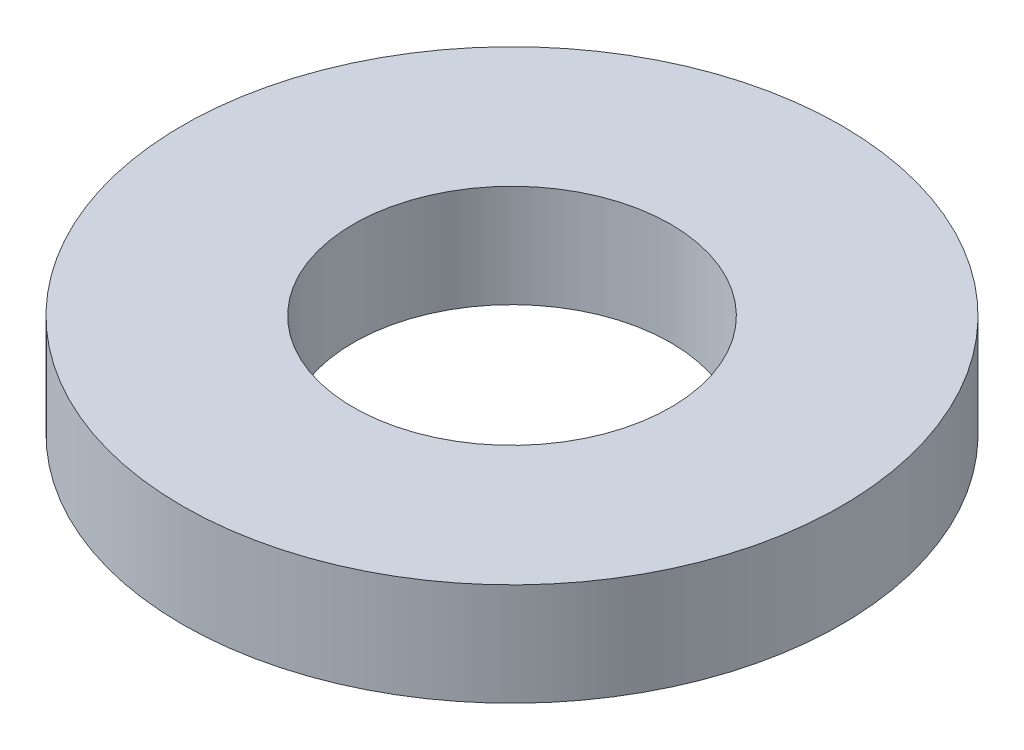
ISO-10303-21;
HEADER;
FILE_DESCRIPTION(('STEP AP214'),'2;1');
FILE_NAME('part.step','',(''),(''),'','','');
FILE_SCHEMA(('AUTOMOTIVE_DESIGN { 1 0 10303 214 1 1 1 1 }'));
ENDSEC;
DATA;
#1=APPLICATION_CONTEXT('core data for automotive mechanical design processes');
#2=APPLICATION_PROTOCOL_DEFINITION('international standard','automotive_design',2000,#1);
#3=PRODUCT_CONTEXT('',#1,'mechanical');
#4=PRODUCT('Part','Part','',(#3));
#5=PRODUCT_RELATED_PRODUCT_CATEGORY('part','',(#4));
#6=PRODUCT_DEFINITION_FORMATION('','',#4);
#7=PRODUCT_DEFINITION_CONTEXT('part definition',#1,'design');
#8=PRODUCT_DEFINITION('design','',#6,#7);
#9=PRODUCT_DEFINITION_SHAPE('','',#8);
#10=(LENGTH_UNIT() NAMED_UNIT(*) SI_UNIT(.MILLI.,.METRE.));
#11=(NAMED_UNIT(*) PLANE_ANGLE_UNIT() SI_UNIT($,.RADIAN.));
#12=(NAMED_UNIT(*) SI_UNIT($,.STERADIAN.) SOLID_ANGLE_UNIT());
#13=UNCERTAINTY_MEASURE_WITH_UNIT(LENGTH_MEASURE(1.E-05),#10,'distance_accuracy_value','');
#14=(GEOMETRIC_REPRESENTATION_CONTEXT(3) GLOBAL_UNCERTAINTY_ASSIGNED_CONTEXT((#13)) GLOBAL_UNIT_ASSIGNED_CONTEXT((#10,
#11,#12)) REPRESENTATION_CONTEXT('',''));
#15=CARTESIAN_POINT('',(0.,0.,0.));
#16=DIRECTION('',(0.,0.,1.));
#17=DIRECTION('',(1.,0.,0.));
#18=AXIS2_PLACEMENT_3D('',#15,#16,#17);
#19=CARTESIAN_POINT('',(0.,21.,0.));
#20=DIRECTION('',(0.,-1.,0.));
#21=DIRECTION('',(0.,0.,-1.));
#22=AXIS2_PLACEMENT_3D('',#19,#20,#21);
#23=CYLINDRICAL_SURFACE('',#22,67.5);
#24=CARTESIAN_POINT('',(0.,21.,0.));
#25=DIRECTION('',(0.,1.,0.));
#26=DIRECTION('',(0.,0.,1.));
#27=AXIS2_PLACEMENT_3D('',#24,#25,#26);
#28=CIRCLE('',#27,67.5);
#29=CARTESIAN_POINT('',(0.,21.,-67.5));
#30=VERTEX_POINT('',#29);
#31=EDGE_CURVE('E10',#30,#30,#28,.T.);
#32=CARTESIAN_POINT('',(0.,0.,0.));
#33=DIRECTION('',(0.,1.,0.));
#34=DIRECTION('',(0.,0.,1.));
#35=AXIS2_PLACEMENT_3D('',#32,#33,#34);
#36=CIRCLE('',#35,67.5);
#37=CARTESIAN_POINT('',(0.,0.,-67.5));
#38=VERTEX_POINT('',#37);
#39=EDGE_CURVE('E37',#38,#38,#36,.T.);
#40=CARTESIAN_POINT('',(0.,21.,-67.5));
#41=CARTESIAN_POINT('',(0.,20.78125,-67.5));
#42=CARTESIAN_POINT('',(0.,20.5625,-67.5));
#43=CARTESIAN_POINT('',(0.,20.125,-67.5));
#44=CARTESIAN_POINT('',(0.,19.90625,-67.5));
#45=CARTESIAN_POINT('',(0.,19.46875,-67.5));
#46=CARTESIAN_POINT('',(0.,19.25,-67.5));
#47=CARTESIAN_POINT('',(0.,18.8125,-67.5));
#48=CARTESIAN_POINT('',(0.,18.59375,-67.5));
#49=CARTESIAN_POINT('',(0.,18.15625,-67.5));
#50=CARTESIAN_POINT('',(0.,17.9375,-67.5));
#51=CARTESIAN_POINT('',(0.,17.5,-67.5));
#52=CARTESIAN_POINT('',(0.,17.28125,-67.5));
#53=CARTESIAN_POINT('',(0.,16.84375,-67.5));
#54=CARTESIAN_POINT('',(0.,16.625,-67.5));
#55=CARTESIAN_POINT('',(0.,16.1875,-67.5));
#56=CARTESIAN_POINT('',(0.,15.96875,-67.5));
#57=CARTESIAN_POINT('',(0.,15.53125,-67.5));
#58=CARTESIAN_POINT('',(0.,15.3125,-67.5));
#59=CARTESIAN_POINT('',(0.,14.875,-67.5));
#60=CARTESIAN_POINT('',(0.,14.65625,-67.5));
#61=CARTESIAN_POINT('',(0.,14.21875,-67.5));
#62=CARTESIAN_POINT('',(0.,14.,-67.5));
#63=CARTESIAN_POINT('',(0.,13.5625,-67.5));
#64=CARTESIAN_POINT('',(0.,13.34375,-67.5));
#65=CARTESIAN_POINT('',(0.,12.90625,-67.5));
#66=CARTESIAN_POINT('',(0.,12.6875,-67.5));
#67=CARTESIAN_POINT('',(0.,12.25,-67.5));
#68=CARTESIAN_POINT('',(0.,12.03125,-67.5));
#69=CARTESIAN_POINT('',(0.,11.59375,-67.5));
#70=CARTESIAN_POINT('',(0.,11.375,-67.5));
#71=CARTESIAN_POINT('',(0.,10.9375,-67.5));
#72=CARTESIAN_POINT('',(0.,10.71875,-67.5));
#73=CARTESIAN_POINT('',(0.,10.28125,-67.5));
#74=CARTESIAN_POINT('',(0.,10.0625,-67.5));
#75=CARTESIAN_POINT('',(0.,9.625,-67.5));
#76=CARTESIAN_POINT('',(0.,9.40625,-67.5));
#77=CARTESIAN_POINT('',(0.,8.96875,-67.5));
#78=CARTESIAN_POINT('',(0.,8.75,-67.5));
#79=CARTESIAN_POINT('',(0.,8.3125,-67.5));
#80=CARTESIAN_POINT('',(0.,8.09375,-67.5));
#81=CARTESIAN_POINT('',(0.,7.65625,-67.5));
#82=CARTESIAN_POINT('',(0.,7.4375,-67.5));
#83=CARTESIAN_POINT('',(0.,7.,-67.5));
#84=CARTESIAN_POINT('',(0.,6.78125,-67.5));
#85=CARTESIAN_POINT('',(0.,6.34375,-67.5));
#86=CARTESIAN_POINT('',(0.,6.125,-67.5));
#87=CARTESIAN_POINT('',(0.,5.6875,-67.5));
#88=CARTESIAN_POINT('',(0.,5.46875,-67.5));
#89=CARTESIAN_POINT('',(0.,5.03125,-67.5));
#90=CARTESIAN_POINT('',(0.,4.8125,-67.5));
#91=CARTESIAN_POINT('',(0.,4.375,-67.5));
#92=CARTESIAN_POINT('',(0.,4.15625,-67.5));
#93=CARTESIAN_POINT('',(0.,3.71875,-67.5));
#94=CARTESIAN_POINT('',(0.,3.5,-67.5));
#95=CARTESIAN_POINT('',(0.,3.0625,-67.5));
#96=CARTESIAN_POINT('',(0.,2.84375,-67.5));
#97=CARTESIAN_POINT('',(0.,2.40625,-67.5));
#98=CARTESIAN_POINT('',(0.,2.1875,-67.5));
#99=CARTESIAN_POINT('',(0.,1.75,-67.5));
#100=CARTESIAN_POINT('',(0.,1.53125,-67.5));
#101=CARTESIAN_POINT('',(0.,1.09375,-67.5));
#102=CARTESIAN_POINT('',(0.,0.875000000000001,-67.5));
#103=CARTESIAN_POINT('',(0.,0.4375,-67.5));
#104=CARTESIAN_POINT('',(0.,0.21875,-67.5));
#105=CARTESIAN_POINT('',(0.,0.,-67.5));
#106=B_SPLINE_CURVE_WITH_KNOTS('',3,(#40,#41,#42,#43,#44,#45,#46,#47,#48,#49,#50,#51,#52,#53,
#54,#55,#56,#57,#58,#59,#60,#61,#62,#63,#64,#65,#66,#67,#68,#69,#70,#71,#72,#73,#74,#75,#76,#77,
#78,#79,#80,#81,#82,#83,#84,#85,#86,#87,#88,#89,#90,#91,#92,#93,#94,#95,#96,#97,#98,#99,#100,
#101,#102,#103,#104,#105),.UNSPECIFIED.,.F.,.F.,(4,2,2,2,2,2,2,2,2,2,2,2,2,2,2,2,2,2,2,2,2,2,2,
2,2,2,2,2,2,2,2,2,4),(0.,0.656250000000001,1.3125,1.96875,2.625,3.28125,3.9375,4.59375,5.25,
5.90625,6.5625,7.21875,7.875,8.53125,9.1875,9.84375,10.5,11.15625,11.8125,12.46875,13.125,
13.78125,14.4375,15.09375,15.75,16.40625,17.0625,17.71875,18.375,19.03125,19.6875,20.34375,21.),.UNSPECIFIED.);
#107=EDGE_CURVE('BSEAM40',#30,#38,#106,.T.);
#108=ORIENTED_EDGE('',*,*,#31,.F.);
#109=ORIENTED_EDGE('',*,*,#39,.T.);
#110=ORIENTED_EDGE('',*,*,#107,.T.);
#111=ORIENTED_EDGE('',*,*,#107,.F.);
#112=EDGE_LOOP('',(#108,#110,#109,#111));
#113=FACE_BOUND('',#112,.T.);
#114=ADVANCED_FACE('F40',(#113),#23,.T.);
#115=CARTESIAN_POINT('',(0.,21.,0.));
#116=DIRECTION('',(0.,1.,0.));
#117=DIRECTION('',(0.,0.,1.));
#118=AXIS2_PLACEMENT_3D('',#115,#116,#117);
#119=PLANE('',#118);
#120=CARTESIAN_POINT('',(0.,21.,0.));
#121=DIRECTION('',(0.,1.,0.));
#122=DIRECTION('',(0.,0.,1.));
#123=AXIS2_PLACEMENT_3D('',#120,#121,#122);
#124=CIRCLE('',#123,32.5);
#125=CARTESIAN_POINT('',(0.,21.,-32.5));
#126=VERTEX_POINT('',#125);
#127=EDGE_CURVE('E50',#126,#126,#124,.T.);
#128=ORIENTED_EDGE('',*,*,#127,.F.);
#129=EDGE_LOOP('',(#128));
#130=FACE_BOUND('',#129,.T.);
#131=ORIENTED_EDGE('',*,*,#31,.T.);
#132=EDGE_LOOP('',(#131));
#133=FACE_BOUND('',#132,.T.);
#134=ADVANCED_FACE('F59',(#130,#133),#119,.T.);
#135=CARTESIAN_POINT('',(0.,0.,0.));
#136=DIRECTION('',(0.,1.,0.));
#137=DIRECTION('',(0.,0.,1.));
#138=AXIS2_PLACEMENT_3D('',#135,#136,#137);
#139=PLANE('',#138);
#140=CARTESIAN_POINT('',(0.,0.,0.));
#141=DIRECTION('',(0.,1.,0.));
#142=DIRECTION('',(0.,0.,1.));
#143=AXIS2_PLACEMENT_3D('',#140,#141,#142);
#144=CIRCLE('',#143,32.5);
#145=CARTESIAN_POINT('',(0.,0.,-32.5));
#146=VERTEX_POINT('',#145);
#147=EDGE_CURVE('E47',#146,#146,#144,.T.);
#148=ORIENTED_EDGE('',*,*,#147,.T.);
#149=EDGE_LOOP('',(#148));
#150=FACE_BOUND('',#149,.T.);
#151=ORIENTED_EDGE('',*,*,#39,.F.);
#152=EDGE_LOOP('',(#151));
#153=FACE_BOUND('',#152,.T.);
#154=ADVANCED_FACE('F58',(#150,#153),#139,.F.);
#155=CARTESIAN_POINT('',(0.,21.,0.));
#156=DIRECTION('',(0.,-1.,0.));
#157=DIRECTION('',(0.,0.,-1.));
#158=AXIS2_PLACEMENT_3D('',#155,#156,#157);
#159=CYLINDRICAL_SURFACE('',#158,32.5);
#160=CARTESIAN_POINT('',(0.,21.,-32.5));
#161=CARTESIAN_POINT('',(0.,20.78125,-32.5));
#162=CARTESIAN_POINT('',(0.,20.5625,-32.5));
#163=CARTESIAN_POINT('',(0.,20.125,-32.5));
#164=CARTESIAN_POINT('',(0.,19.90625,-32.5));
#165=CARTESIAN_POINT('',(0.,19.46875,-32.5));
#166=CARTESIAN_POINT('',(0.,19.25,-32.5));
#167=CARTESIAN_POINT('',(0.,18.8125,-32.5));
#168=CARTESIAN_POINT('',(0.,18.59375,-32.5));
#169=CARTESIAN_POINT('',(0.,18.15625,-32.5));
#170=CARTESIAN_POINT('',(0.,17.9375,-32.5));
#171=CARTESIAN_POINT('',(0.,17.5,-32.5));
#172=CARTESIAN_POINT('',(0.,17.28125,-32.5));
#173=CARTESIAN_POINT('',(0.,16.84375,-32.5));
#174=CARTESIAN_POINT('',(0.,16.625,-32.5));
#175=CARTESIAN_POINT('',(0.,16.1875,-32.5));
#176=CARTESIAN_POINT('',(0.,15.96875,-32.5));
#177=CARTESIAN_POINT('',(0.,15.53125,-32.5));
#178=CARTESIAN_POINT('',(0.,15.3125,-32.5));
#179=CARTESIAN_POINT('',(0.,14.875,-32.5));
#180=CARTESIAN_POINT('',(0.,14.65625,-32.5));
#181=CARTESIAN_POINT('',(0.,14.21875,-32.5));
#182=CARTESIAN_POINT('',(0.,14.,-32.5));
#183=CARTESIAN_POINT('',(0.,13.5625,-32.5));
#184=CARTESIAN_POINT('',(0.,13.34375,-32.5));
#185=CARTESIAN_POINT('',(0.,12.90625,-32.5));
#186=CARTESIAN_POINT('',(0.,12.6875,-32.5));
#187=CARTESIAN_POINT('',(0.,12.25,-32.5));
#188=CARTESIAN_POINT('',(0.,12.03125,-32.5));
#189=CARTESIAN_POINT('',(0.,11.59375,-32.5));
#190=CARTESIAN_POINT('',(0.,11.375,-32.5));
#191=CARTESIAN_POINT('',(0.,10.9375,-32.5));
#192=CARTESIAN_POINT('',(0.,10.71875,-32.5));
#193=CARTESIAN_POINT('',(0.,10.28125,-32.5));
#194=CARTESIAN_POINT('',(0.,10.0625,-32.5));
#195=CARTESIAN_POINT('',(0.,9.625,-32.5));
#196=CARTESIAN_POINT('',(0.,9.40625,-32.5));
#197=CARTESIAN_POINT('',(0.,8.96875,-32.5));
#198=CARTESIAN_POINT('',(0.,8.75,-32.5));
#199=CARTESIAN_POINT('',(0.,8.3125,-32.5));
#200=CARTESIAN_POINT('',(0.,8.09375,-32.5));
#201=CARTESIAN_POINT('',(0.,7.65625,-32.5));
#202=CARTESIAN_POINT('',(0.,7.4375,-32.5));
#203=CARTESIAN_POINT('',(0.,7.,-32.5));
#204=CARTESIAN_POINT('',(0.,6.78125,-32.5));
#205=CARTESIAN_POINT('',(0.,6.34375,-32.5));
#206=CARTESIAN_POINT('',(0.,6.125,-32.5));
#207=CARTESIAN_POINT('',(0.,5.6875,-32.5));
#208=CARTESIAN_POINT('',(0.,5.46875,-32.5));
#209=CARTESIAN_POINT('',(0.,5.03125,-32.5));
#210=CARTESIAN_POINT('',(0.,4.8125,-32.5));
#211=CARTESIAN_POINT('',(0.,4.375,-32.5));
#212=CARTESIAN_POINT('',(0.,4.15625,-32.5));
#213=CARTESIAN_POINT('',(0.,3.71875,-32.5));
#214=CARTESIAN_POINT('',(0.,3.5,-32.5));
#215=CARTESIAN_POINT('',(0.,3.0625,-32.5));
#216=CARTESIAN_POINT('',(0.,2.84375,-32.5));
#217=CARTESIAN_POINT('',(0.,2.40625,-32.5));
#218=CARTESIAN_POINT('',(0.,2.1875,-32.5));
#219=CARTESIAN_POINT('',(0.,1.75,-32.5));
#220=CARTESIAN_POINT('',(0.,1.53125,-32.5));
#221=CARTESIAN_POINT('',(0.,1.09375,-32.5));
#222=CARTESIAN_POINT('',(0.,0.875000000000001,-32.5));
#223=CARTESIAN_POINT('',(0.,0.4375,-32.5));
#224=CARTESIAN_POINT('',(0.,0.21875,-32.5));
#225=CARTESIAN_POINT('',(0.,0.,-32.5));
#226=B_SPLINE_CURVE_WITH_KNOTS('',3,(#160,#161,#162,#163,#164,#165,#166,#167,#168,#169,#170,
#171,#172,#173,#174,#175,#176,#177,#178,#179,#180,#181,#182,#183,#184,#185,#186,#187,#188,#189,
#190,#191,#192,#193,#194,#195,#196,#197,#198,#199,#200,#201,#202,#203,#204,#205,#206,#207,#208,
#209,#210,#211,#212,#213,#214,#215,#216,#217,#218,#219,#220,#221,#222,#223,#224,#225),
.UNSPECIFIED.,.F.,.F.,(4,2,2,2,2,2,2,2,2,2,2,2,2,2,2,2,2,2,2,2,2,2,2,2,2,2,2,2,2,2,2,2,4),(0.,
0.656249999999997,1.3125,1.96875,2.625,3.28125,3.9375,4.59375,5.25,5.90625,6.5625,7.21875,7.875,
8.53125,9.1875,9.84375,10.5,11.15625,11.8125,12.46875,13.125,13.78125,14.4375,15.09375,15.75,
16.40625,17.0625,17.71875,18.375,19.03125,19.6875,20.34375,21.),.UNSPECIFIED.);
#227=EDGE_CURVE('BSEAM54',#126,#146,#226,.T.);
#228=ORIENTED_EDGE('',*,*,#127,.T.);
#229=ORIENTED_EDGE('',*,*,#147,.F.);
#230=ORIENTED_EDGE('',*,*,#227,.T.);
#231=ORIENTED_EDGE('',*,*,#227,.F.);
#232=EDGE_LOOP('',(#228,#230,#229,#231));
#233=FACE_BOUND('',#232,.T.);
#234=ADVANCED_FACE('F54',(#233),#159,.F.);
#235=CLOSED_SHELL('',(#114,#134,#154,#234));
#236=MANIFOLD_SOLID_BREP('B2',#235);
#237=ADVANCED_BREP_SHAPE_REPRESENTATION('',(#18,#236),#14);
#238=SHAPE_DEFINITION_REPRESENTATION(#9,#237);
ENDSEC;
END-ISO-10303-21;
